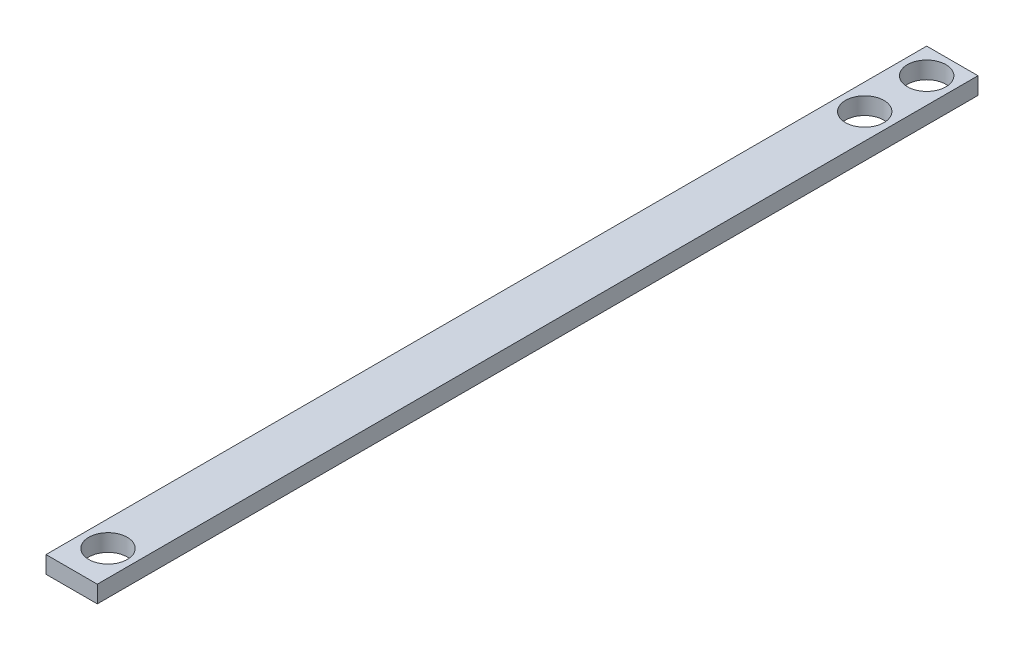
ISO-10303-21;
HEADER;
FILE_DESCRIPTION(('STEP AP214'),'2;1');
FILE_NAME('part.step','',(''),(''),'','','');
FILE_SCHEMA(('AUTOMOTIVE_DESIGN { 1 0 10303 214 1 1 1 1 }'));
ENDSEC;
DATA;
#1=APPLICATION_CONTEXT('core data for automotive mechanical design processes');
#2=APPLICATION_PROTOCOL_DEFINITION('international standard','automotive_design',2000,#1);
#3=PRODUCT_CONTEXT('',#1,'mechanical');
#4=PRODUCT('Part','Part','',(#3));
#5=PRODUCT_RELATED_PRODUCT_CATEGORY('part','',(#4));
#6=PRODUCT_DEFINITION_FORMATION('','',#4);
#7=PRODUCT_DEFINITION_CONTEXT('part definition',#1,'design');
#8=PRODUCT_DEFINITION('design','',#6,#7);
#9=PRODUCT_DEFINITION_SHAPE('','',#8);
#10=(LENGTH_UNIT() NAMED_UNIT(*) SI_UNIT(.MILLI.,.METRE.));
#11=(NAMED_UNIT(*) PLANE_ANGLE_UNIT() SI_UNIT($,.RADIAN.));
#12=(NAMED_UNIT(*) SI_UNIT($,.STERADIAN.) SOLID_ANGLE_UNIT());
#13=UNCERTAINTY_MEASURE_WITH_UNIT(LENGTH_MEASURE(1.E-05),#10,'distance_accuracy_value','');
#14=(GEOMETRIC_REPRESENTATION_CONTEXT(3) GLOBAL_UNCERTAINTY_ASSIGNED_CONTEXT((#13)) GLOBAL_UNIT_ASSIGNED_CONTEXT((#10,
#11,#12)) REPRESENTATION_CONTEXT('',''));
#15=CARTESIAN_POINT('',(0.,0.,0.));
#16=DIRECTION('',(0.,0.,1.));
#17=DIRECTION('',(1.,0.,0.));
#18=AXIS2_PLACEMENT_3D('',#15,#16,#17);
#19=CARTESIAN_POINT('',(0.,0.,615.95));
#20=DIRECTION('',(1.,0.,0.));
#21=DIRECTION('',(0.,0.,-1.));
#22=AXIS2_PLACEMENT_3D('',#19,#20,#21);
#23=PLANE('',#22);
#24=DIRECTION('',(0.,0.,-1.));
#25=VECTOR('',#24,1.);
#26=CARTESIAN_POINT('',(0.,12.7,615.95));
#27=LINE('',#26,#25);
#28=CARTESIAN_POINT('',(0.,12.7,615.95));
#29=VERTEX_POINT('',#28);
#30=CARTESIAN_POINT('',(0.,12.7,-38.1));
#31=VERTEX_POINT('',#30);
#32=EDGE_CURVE('E120',#29,#31,#27,.T.);
#33=ORIENTED_EDGE('',*,*,#32,.T.);
#34=DIRECTION('',(0.,1.,0.));
#35=VECTOR('',#34,1.);
#36=CARTESIAN_POINT('',(0.,12.7,-38.1));
#37=LINE('',#36,#35);
#38=CARTESIAN_POINT('',(0.,0.,-38.1));
#39=VERTEX_POINT('',#38);
#40=EDGE_CURVE('E87',#39,#31,#37,.T.);
#41=ORIENTED_EDGE('',*,*,#40,.F.);
#42=DIRECTION('',(0.,0.,-1.));
#43=VECTOR('',#42,1.);
#44=CARTESIAN_POINT('',(0.,0.,615.95));
#45=LINE('',#44,#43);
#46=CARTESIAN_POINT('',(0.,0.,615.95));
#47=VERTEX_POINT('',#46);
#48=EDGE_CURVE('E11',#47,#39,#45,.T.);
#49=ORIENTED_EDGE('',*,*,#48,.F.);
#50=DIRECTION('',(0.,-1.,0.));
#51=VECTOR('',#50,1.);
#52=CARTESIAN_POINT('',(0.,0.,615.95));
#53=LINE('',#52,#51);
#54=EDGE_CURVE('E114',#29,#47,#53,.T.);
#55=ORIENTED_EDGE('',*,*,#54,.F.);
#56=EDGE_LOOP('',(#33,#41,#49,#55));
#57=FACE_BOUND('',#56,.T.);
#58=ADVANCED_FACE('F35',(#57),#23,.F.);
#59=CARTESIAN_POINT('',(0.,0.,615.95));
#60=DIRECTION('',(0.,1.,0.));
#61=DIRECTION('',(0.,0.,1.));
#62=AXIS2_PLACEMENT_3D('',#59,#60,#61);
#63=PLANE('',#62);
#64=CARTESIAN_POINT('',(19.05,0.,-19.0373));
#65=DIRECTION('',(0.,1.,0.));
#66=DIRECTION('',(0.,0.,1.));
#67=AXIS2_PLACEMENT_3D('',#64,#65,#66);
#68=CIRCLE('',#67,14.3002);
#69=CARTESIAN_POINT('',(19.05,0.,-4.73710000000001));
#70=VERTEX_POINT('',#69);
#71=EDGE_CURVE('E93',#70,#70,#68,.T.);
#72=ORIENTED_EDGE('',*,*,#71,.T.);
#73=EDGE_LOOP('',(#72));
#74=FACE_BOUND('',#73,.T.);
#75=CARTESIAN_POINT('',(19.05,0.,588.9498));
#76=DIRECTION('',(0.,1.,0.));
#77=DIRECTION('',(0.,0.,1.));
#78=AXIS2_PLACEMENT_3D('',#75,#76,#77);
#79=CIRCLE('',#78,14.3002);
#80=CARTESIAN_POINT('',(19.05,0.,603.25));
#81=VERTEX_POINT('',#80);
#82=EDGE_CURVE('E111',#81,#81,#79,.T.);
#83=ORIENTED_EDGE('',*,*,#82,.T.);
#84=EDGE_LOOP('',(#83));
#85=FACE_BOUND('',#84,.T.);
#86=CARTESIAN_POINT('',(19.05,0.,27.0002));
#87=DIRECTION('',(0.,1.,0.));
#88=DIRECTION('',(0.,0.,1.));
#89=AXIS2_PLACEMENT_3D('',#86,#87,#88);
#90=CIRCLE('',#89,14.3002);
#91=CARTESIAN_POINT('',(19.05,0.,41.3004));
#92=VERTEX_POINT('',#91);
#93=EDGE_CURVE('E106',#92,#92,#90,.T.);
#94=ORIENTED_EDGE('',*,*,#93,.T.);
#95=EDGE_LOOP('',(#94));
#96=FACE_BOUND('',#95,.T.);
#97=ORIENTED_EDGE('',*,*,#48,.T.);
#98=DIRECTION('',(-1.,0.,0.));
#99=VECTOR('',#98,1.);
#100=CARTESIAN_POINT('',(38.1,0.,-38.1));
#101=LINE('',#100,#99);
#102=CARTESIAN_POINT('',(38.1,0.,-38.1));
#103=VERTEX_POINT('',#102);
#104=EDGE_CURVE('E81',#103,#39,#101,.T.);
#105=ORIENTED_EDGE('',*,*,#104,.F.);
#106=DIRECTION('',(0.,0.,-1.));
#107=VECTOR('',#106,1.);
#108=CARTESIAN_POINT('',(38.1,0.,615.95));
#109=LINE('',#108,#107);
#110=CARTESIAN_POINT('',(38.1,0.,615.95));
#111=VERTEX_POINT('',#110);
#112=EDGE_CURVE('E42',#111,#103,#109,.T.);
#113=ORIENTED_EDGE('',*,*,#112,.F.);
#114=DIRECTION('',(1.,0.,0.));
#115=VECTOR('',#114,1.);
#116=CARTESIAN_POINT('',(0.,0.,615.95));
#117=LINE('',#116,#115);
#118=EDGE_CURVE('E116',#47,#111,#117,.T.);
#119=ORIENTED_EDGE('',*,*,#118,.F.);
#120=EDGE_LOOP('',(#97,#105,#113,#119));
#121=FACE_BOUND('',#120,.T.);
#122=ADVANCED_FACE('F82',(#74,#85,#96,#121),#63,.F.);
#123=CARTESIAN_POINT('',(38.1,0.,615.95));
#124=DIRECTION('',(-1.,0.,0.));
#125=DIRECTION('',(0.,0.,1.));
#126=AXIS2_PLACEMENT_3D('',#123,#124,#125);
#127=PLANE('',#126);
#128=ORIENTED_EDGE('',*,*,#112,.T.);
#129=DIRECTION('',(0.,-1.,0.));
#130=VECTOR('',#129,1.);
#131=CARTESIAN_POINT('',(38.1,12.7,-38.1));
#132=LINE('',#131,#130);
#133=CARTESIAN_POINT('',(38.1,12.7,-38.1));
#134=VERTEX_POINT('',#133);
#135=EDGE_CURVE('E77',#134,#103,#132,.T.);
#136=ORIENTED_EDGE('',*,*,#135,.F.);
#137=DIRECTION('',(0.,0.,-1.));
#138=VECTOR('',#137,1.);
#139=CARTESIAN_POINT('',(38.1,12.7,615.95));
#140=LINE('',#139,#138);
#141=CARTESIAN_POINT('',(38.1,12.7,615.95));
#142=VERTEX_POINT('',#141);
#143=EDGE_CURVE('E79',#142,#134,#140,.T.);
#144=ORIENTED_EDGE('',*,*,#143,.F.);
#145=DIRECTION('',(0.,1.,0.));
#146=VECTOR('',#145,1.);
#147=CARTESIAN_POINT('',(38.1,0.,615.95));
#148=LINE('',#147,#146);
#149=EDGE_CURVE('E54',#111,#142,#148,.T.);
#150=ORIENTED_EDGE('',*,*,#149,.F.);
#151=EDGE_LOOP('',(#128,#136,#144,#150));
#152=FACE_BOUND('',#151,.T.);
#153=ADVANCED_FACE('F75',(#152),#127,.F.);
#154=CARTESIAN_POINT('',(0.,12.7,615.95));
#155=DIRECTION('',(0.,-1.,0.));
#156=DIRECTION('',(0.,0.,-1.));
#157=AXIS2_PLACEMENT_3D('',#154,#155,#156);
#158=PLANE('',#157);
#159=CARTESIAN_POINT('',(19.05,12.7,-19.0373));
#160=DIRECTION('',(0.,1.,0.));
#161=DIRECTION('',(0.,0.,1.));
#162=AXIS2_PLACEMENT_3D('',#159,#160,#161);
#163=CIRCLE('',#162,14.3002);
#164=CARTESIAN_POINT('',(19.05,12.7,-4.73710000000001));
#165=VERTEX_POINT('',#164);
#166=EDGE_CURVE('E96',#165,#165,#163,.T.);
#167=ORIENTED_EDGE('',*,*,#166,.F.);
#168=EDGE_LOOP('',(#167));
#169=FACE_BOUND('',#168,.T.);
#170=CARTESIAN_POINT('',(19.05,12.7,588.9498));
#171=DIRECTION('',(0.,1.,0.));
#172=DIRECTION('',(0.,0.,1.));
#173=AXIS2_PLACEMENT_3D('',#170,#171,#172);
#174=CIRCLE('',#173,14.3002);
#175=CARTESIAN_POINT('',(19.05,12.7,603.25));
#176=VERTEX_POINT('',#175);
#177=EDGE_CURVE('E103',#176,#176,#174,.T.);
#178=ORIENTED_EDGE('',*,*,#177,.F.);
#179=EDGE_LOOP('',(#178));
#180=FACE_BOUND('',#179,.T.);
#181=CARTESIAN_POINT('',(19.05,12.7,27.0002));
#182=DIRECTION('',(0.,1.,0.));
#183=DIRECTION('',(0.,0.,1.));
#184=AXIS2_PLACEMENT_3D('',#181,#182,#183);
#185=CIRCLE('',#184,14.3002);
#186=CARTESIAN_POINT('',(19.05,12.7,41.3004));
#187=VERTEX_POINT('',#186);
#188=EDGE_CURVE('E102',#187,#187,#185,.T.);
#189=ORIENTED_EDGE('',*,*,#188,.F.);
#190=EDGE_LOOP('',(#189));
#191=FACE_BOUND('',#190,.T.);
#192=ORIENTED_EDGE('',*,*,#143,.T.);
#193=DIRECTION('',(1.,0.,0.));
#194=VECTOR('',#193,1.);
#195=CARTESIAN_POINT('',(38.1,12.7,-38.1));
#196=LINE('',#195,#194);
#197=EDGE_CURVE('E92',#31,#134,#196,.T.);
#198=ORIENTED_EDGE('',*,*,#197,.F.);
#199=ORIENTED_EDGE('',*,*,#32,.F.);
#200=DIRECTION('',(-1.,0.,0.));
#201=VECTOR('',#200,1.);
#202=CARTESIAN_POINT('',(0.,12.7,615.95));
#203=LINE('',#202,#201);
#204=EDGE_CURVE('E49',#142,#29,#203,.T.);
#205=ORIENTED_EDGE('',*,*,#204,.F.);
#206=EDGE_LOOP('',(#192,#198,#199,#205));
#207=FACE_BOUND('',#206,.T.);
#208=ADVANCED_FACE('F123',(#169,#180,#191,#207),#158,.F.);
#209=CARTESIAN_POINT('',(0.,0.,615.95));
#210=DIRECTION('',(0.,0.,-1.));
#211=DIRECTION('',(-1.,0.,0.));
#212=AXIS2_PLACEMENT_3D('',#209,#210,#211);
#213=PLANE('',#212);
#214=ORIENTED_EDGE('',*,*,#54,.T.);
#215=ORIENTED_EDGE('',*,*,#118,.T.);
#216=ORIENTED_EDGE('',*,*,#149,.T.);
#217=ORIENTED_EDGE('',*,*,#204,.T.);
#218=EDGE_LOOP('',(#214,#215,#216,#217));
#219=FACE_BOUND('',#218,.T.);
#220=ADVANCED_FACE('F126',(#219),#213,.F.);
#221=CARTESIAN_POINT('',(19.05,-749.3,27.0002));
#222=DIRECTION('',(0.,1.,0.));
#223=DIRECTION('',(0.,0.,1.));
#224=AXIS2_PLACEMENT_3D('',#221,#222,#223);
#225=CYLINDRICAL_SURFACE('',#224,14.3002);
#226=ORIENTED_EDGE('',*,*,#188,.T.);
#227=EDGE_LOOP('',(#226));
#228=FACE_BOUND('',#227,.T.);
#229=ORIENTED_EDGE('',*,*,#93,.F.);
#230=EDGE_LOOP('',(#229));
#231=FACE_BOUND('',#230,.T.);
#232=ADVANCED_FACE('F128',(#228,#231),#225,.F.);
#233=CARTESIAN_POINT('',(19.05,-749.3,588.9498));
#234=DIRECTION('',(0.,1.,0.));
#235=DIRECTION('',(0.,0.,1.));
#236=AXIS2_PLACEMENT_3D('',#233,#234,#235);
#237=CYLINDRICAL_SURFACE('',#236,14.3002);
#238=ORIENTED_EDGE('',*,*,#177,.T.);
#239=EDGE_LOOP('',(#238));
#240=FACE_BOUND('',#239,.T.);
#241=ORIENTED_EDGE('',*,*,#82,.F.);
#242=EDGE_LOOP('',(#241));
#243=FACE_BOUND('',#242,.T.);
#244=ADVANCED_FACE('F134',(#240,#243),#237,.F.);
#245=CARTESIAN_POINT('',(0.,0.,-38.1));
#246=DIRECTION('',(0.,0.,-1.));
#247=DIRECTION('',(-1.,0.,0.));
#248=AXIS2_PLACEMENT_3D('',#245,#246,#247);
#249=PLANE('',#248);
#250=ORIENTED_EDGE('',*,*,#135,.T.);
#251=ORIENTED_EDGE('',*,*,#104,.T.);
#252=ORIENTED_EDGE('',*,*,#40,.T.);
#253=ORIENTED_EDGE('',*,*,#197,.T.);
#254=EDGE_LOOP('',(#250,#251,#252,#253));
#255=FACE_BOUND('',#254,.T.);
#256=ADVANCED_FACE('F90',(#255),#249,.T.);
#257=CARTESIAN_POINT('',(19.05,-88.9,-19.0373));
#258=DIRECTION('',(0.,1.,0.));
#259=DIRECTION('',(0.,0.,1.));
#260=AXIS2_PLACEMENT_3D('',#257,#258,#259);
#261=CYLINDRICAL_SURFACE('',#260,14.3002);
#262=ORIENTED_EDGE('',*,*,#166,.T.);
#263=EDGE_LOOP('',(#262));
#264=FACE_BOUND('',#263,.T.);
#265=ORIENTED_EDGE('',*,*,#71,.F.);
#266=EDGE_LOOP('',(#265));
#267=FACE_BOUND('',#266,.T.);
#268=ADVANCED_FACE('F161',(#264,#267),#261,.F.);
#269=CLOSED_SHELL('',(#58,#122,#153,#208,#220,#232,#244,#256,#268));
#270=MANIFOLD_SOLID_BREP('B2',#269);
#271=ADVANCED_BREP_SHAPE_REPRESENTATION('',(#18,#270),#14);
#272=SHAPE_DEFINITION_REPRESENTATION(#9,#271);
ENDSEC;
END-ISO-10303-21;
